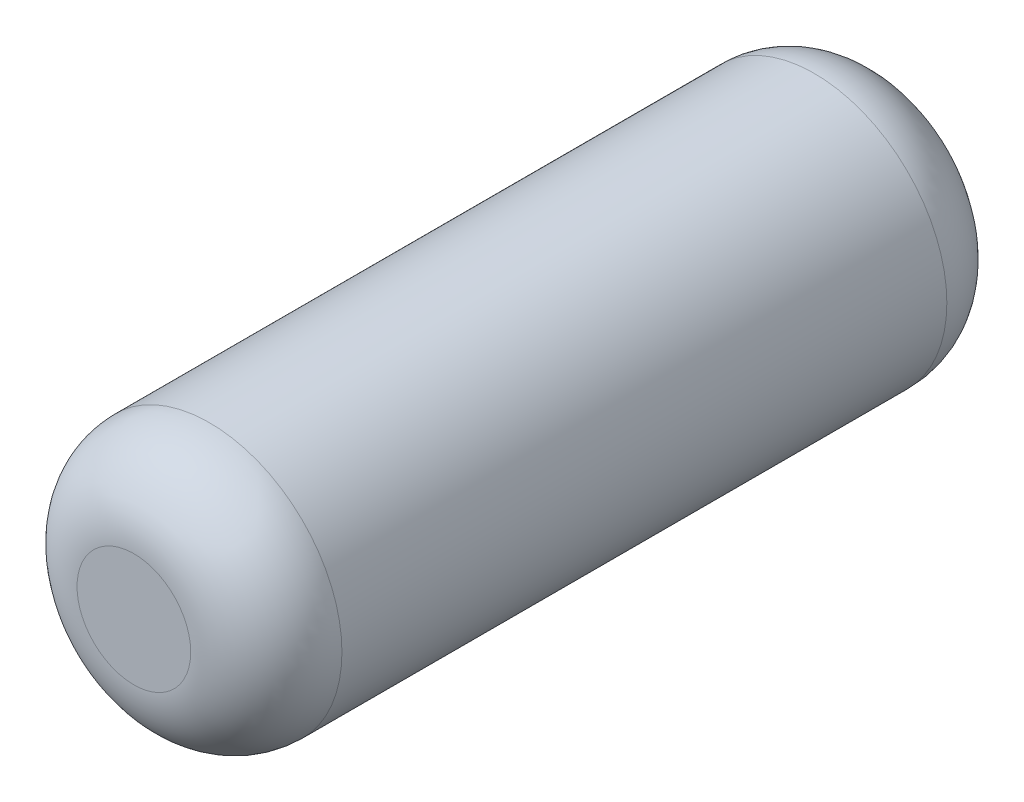
ISO-10303-21;
HEADER;
FILE_DESCRIPTION(('STEP AP214'),'2;1');
FILE_NAME('part.step','',(''),(''),'','','');
FILE_SCHEMA(('AUTOMOTIVE_DESIGN { 1 0 10303 214 1 1 1 1 }'));
ENDSEC;
DATA;
#1=APPLICATION_CONTEXT('core data for automotive mechanical design processes');
#2=APPLICATION_PROTOCOL_DEFINITION('international standard','automotive_design',2000,#1);
#3=PRODUCT_CONTEXT('',#1,'mechanical');
#4=PRODUCT('Part','Part','',(#3));
#5=PRODUCT_RELATED_PRODUCT_CATEGORY('part','',(#4));
#6=PRODUCT_DEFINITION_FORMATION('','',#4);
#7=PRODUCT_DEFINITION_CONTEXT('part definition',#1,'design');
#8=PRODUCT_DEFINITION('design','',#6,#7);
#9=PRODUCT_DEFINITION_SHAPE('','',#8);
#10=(LENGTH_UNIT() NAMED_UNIT(*) SI_UNIT(.MILLI.,.METRE.));
#11=(NAMED_UNIT(*) PLANE_ANGLE_UNIT() SI_UNIT($,.RADIAN.));
#12=(NAMED_UNIT(*) SI_UNIT($,.STERADIAN.) SOLID_ANGLE_UNIT());
#13=UNCERTAINTY_MEASURE_WITH_UNIT(LENGTH_MEASURE(1.E-05),#10,'distance_accuracy_value','');
#14=(GEOMETRIC_REPRESENTATION_CONTEXT(3) GLOBAL_UNCERTAINTY_ASSIGNED_CONTEXT((#13)) GLOBAL_UNIT_ASSIGNED_CONTEXT((#10,
#11,#12)) REPRESENTATION_CONTEXT('',''));
#15=CARTESIAN_POINT('',(0.,0.,0.));
#16=DIRECTION('',(0.,0.,1.));
#17=DIRECTION('',(1.,0.,0.));
#18=AXIS2_PLACEMENT_3D('',#15,#16,#17);
#19=CARTESIAN_POINT('',(0.,0.,254.));
#20=DIRECTION('',(0.,0.,-1.));
#21=DIRECTION('',(-1.,0.,0.));
#22=AXIS2_PLACEMENT_3D('',#19,#20,#21);
#23=CYLINDRICAL_SURFACE('',#22,44.4904458598726);
#24=CARTESIAN_POINT('',(0.,0.,25.4));
#25=DIRECTION('',(0.,0.,1.));
#26=DIRECTION('',(1.,0.,0.));
#27=AXIS2_PLACEMENT_3D('',#24,#25,#26);
#28=CIRCLE('',#27,44.4904458598726);
#29=CARTESIAN_POINT('',(44.4904458598726,0.,25.4));
#30=VERTEX_POINT('',#29);
#31=EDGE_CURVE('E45',#30,#30,#28,.T.);
#32=ORIENTED_EDGE('',*,*,#31,.T.);
#33=EDGE_LOOP('',(#32));
#34=FACE_BOUND('',#33,.T.);
#35=CARTESIAN_POINT('',(0.,0.,228.6));
#36=DIRECTION('',(0.,0.,1.));
#37=DIRECTION('',(1.,0.,0.));
#38=AXIS2_PLACEMENT_3D('',#35,#36,#37);
#39=CIRCLE('',#38,44.4904458598726);
#40=CARTESIAN_POINT('',(44.4904458598726,0.,228.6));
#41=VERTEX_POINT('',#40);
#42=EDGE_CURVE('E49',#41,#41,#39,.F.);
#43=ORIENTED_EDGE('',*,*,#42,.T.);
#44=EDGE_LOOP('',(#43));
#45=FACE_BOUND('',#44,.T.);
#46=ADVANCED_FACE('F34',(#34,#45),#23,.T.);
#47=CARTESIAN_POINT('',(0.,0.,254.));
#48=DIRECTION('',(0.,0.,1.));
#49=DIRECTION('',(1.,0.,0.));
#50=AXIS2_PLACEMENT_3D('',#47,#48,#49);
#51=PLANE('',#50);
#52=CARTESIAN_POINT('',(0.,0.,254.));
#53=DIRECTION('',(0.,0.,1.));
#54=DIRECTION('',(1.,0.,0.));
#55=AXIS2_PLACEMENT_3D('',#52,#53,#54);
#56=CIRCLE('',#55,19.0904458598726);
#57=CARTESIAN_POINT('',(19.0904458598726,0.,254.));
#58=VERTEX_POINT('',#57);
#59=EDGE_CURVE('E10',#58,#58,#56,.T.);
#60=ORIENTED_EDGE('',*,*,#59,.T.);
#61=EDGE_LOOP('',(#60));
#62=FACE_BOUND('',#61,.T.);
#63=ADVANCED_FACE('F65',(#62),#51,.T.);
#64=CARTESIAN_POINT('',(0.,0.,0.));
#65=DIRECTION('',(0.,0.,1.));
#66=DIRECTION('',(1.,0.,0.));
#67=AXIS2_PLACEMENT_3D('',#64,#65,#66);
#68=PLANE('',#67);
#69=CARTESIAN_POINT('',(0.,0.,0.));
#70=DIRECTION('',(0.,0.,1.));
#71=DIRECTION('',(1.,0.,0.));
#72=AXIS2_PLACEMENT_3D('',#69,#70,#71);
#73=CIRCLE('',#72,19.0904458598726);
#74=CARTESIAN_POINT('',(19.0904458598726,0.,0.));
#75=VERTEX_POINT('',#74);
#76=EDGE_CURVE('E41',#75,#75,#73,.F.);
#77=ORIENTED_EDGE('',*,*,#76,.T.);
#78=EDGE_LOOP('',(#77));
#79=FACE_BOUND('',#78,.T.);
#80=ADVANCED_FACE('F62',(#79),#68,.F.);
#81=CARTESIAN_POINT('',(0.,0.,25.4));
#82=DIRECTION('',(0.,0.,1.));
#83=DIRECTION('',(1.,0.,0.));
#84=AXIS2_PLACEMENT_3D('',#81,#82,#83);
#85=DEGENERATE_TOROIDAL_SURFACE('',#84,19.0904458598726,25.4,.T.);
#86=ORIENTED_EDGE('',*,*,#76,.F.);
#87=EDGE_LOOP('',(#86));
#88=FACE_BOUND('',#87,.T.);
#89=ORIENTED_EDGE('',*,*,#31,.F.);
#90=EDGE_LOOP('',(#89));
#91=FACE_BOUND('',#90,.T.);
#92=ADVANCED_FACE('F58',(#88,#91),#85,.T.);
#93=CARTESIAN_POINT('',(0.,0.,228.6));
#94=DIRECTION('',(0.,0.,1.));
#95=DIRECTION('',(1.,0.,0.));
#96=AXIS2_PLACEMENT_3D('',#93,#94,#95);
#97=DEGENERATE_TOROIDAL_SURFACE('',#96,19.0904458598726,25.4,.T.);
#98=ORIENTED_EDGE('',*,*,#42,.F.);
#99=EDGE_LOOP('',(#98));
#100=FACE_BOUND('',#99,.T.);
#101=ORIENTED_EDGE('',*,*,#59,.F.);
#102=EDGE_LOOP('',(#101));
#103=FACE_BOUND('',#102,.T.);
#104=ADVANCED_FACE('F36',(#100,#103),#97,.T.);
#105=CLOSED_SHELL('',(#46,#63,#80,#92,#104));
#106=MANIFOLD_SOLID_BREP('B2',#105);
#107=ADVANCED_BREP_SHAPE_REPRESENTATION('',(#18,#106),#14);
#108=SHAPE_DEFINITION_REPRESENTATION(#9,#107);
ENDSEC;
END-ISO-10303-21;
